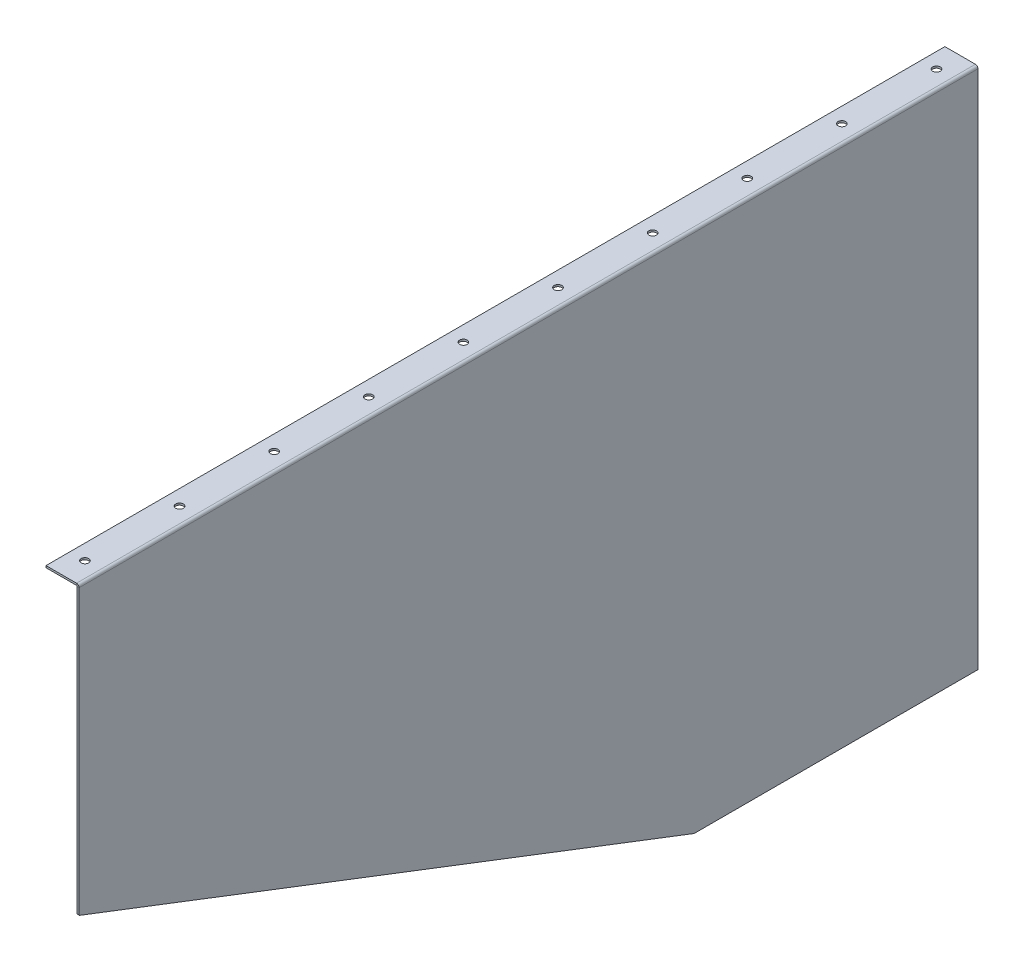
ISO-10303-21;
HEADER;
FILE_DESCRIPTION(('STEP AP214'),'2;1');
FILE_NAME('part.step','',(''),(''),'','','');
FILE_SCHEMA(('AUTOMOTIVE_DESIGN { 1 0 10303 214 1 1 1 1 }'));
ENDSEC;
DATA;
#1=APPLICATION_CONTEXT('core data for automotive mechanical design processes');
#2=APPLICATION_PROTOCOL_DEFINITION('international standard','automotive_design',2000,#1);
#3=PRODUCT_CONTEXT('',#1,'mechanical');
#4=PRODUCT('Part','Part','',(#3));
#5=PRODUCT_RELATED_PRODUCT_CATEGORY('part','',(#4));
#6=PRODUCT_DEFINITION_FORMATION('','',#4);
#7=PRODUCT_DEFINITION_CONTEXT('part definition',#1,'design');
#8=PRODUCT_DEFINITION('design','',#6,#7);
#9=PRODUCT_DEFINITION_SHAPE('','',#8);
#10=(LENGTH_UNIT() NAMED_UNIT(*) SI_UNIT(.MILLI.,.METRE.));
#11=(NAMED_UNIT(*) PLANE_ANGLE_UNIT() SI_UNIT($,.RADIAN.));
#12=(NAMED_UNIT(*) SI_UNIT($,.STERADIAN.) SOLID_ANGLE_UNIT());
#13=UNCERTAINTY_MEASURE_WITH_UNIT(LENGTH_MEASURE(1.E-05),#10,'distance_accuracy_value','');
#14=(GEOMETRIC_REPRESENTATION_CONTEXT(3) GLOBAL_UNCERTAINTY_ASSIGNED_CONTEXT((#13)) GLOBAL_UNIT_ASSIGNED_CONTEXT((#10,
#11,#12)) REPRESENTATION_CONTEXT('',''));
#15=CARTESIAN_POINT('',(0.,0.,0.));
#16=DIRECTION('',(0.,0.,1.));
#17=DIRECTION('',(1.,0.,0.));
#18=AXIS2_PLACEMENT_3D('',#15,#16,#17);
#19=CARTESIAN_POINT('',(-0.00875509888786665,0.736600000000122,0.));
#20=DIRECTION('',(0.,1.,0.));
#21=DIRECTION('',(0.,0.,-1.));
#22=AXIS2_PLACEMENT_3D('',#19,#20,#21);
#23=PLANE('',#22);
#24=CARTESIAN_POINT('',(-18.8726775494439,0.736600000000053,-24.9999999999999));
#25=DIRECTION('',(0.,-1.,0.));
#26=DIRECTION('',(1.,0.,0.));
#27=AXIS2_PLACEMENT_3D('',#24,#25,#26);
#28=CIRCLE('',#27,4.);
#29=CARTESIAN_POINT('',(-14.8726775494439,0.736600000000067,-24.9999999999999));
#30=VERTEX_POINT('',#29);
#31=EDGE_CURVE('E217',#30,#30,#28,.T.);
#32=ORIENTED_EDGE('',*,*,#31,.F.);
#33=EDGE_LOOP('',(#32));
#34=FACE_BOUND('',#33,.T.);
#35=CARTESIAN_POINT('',(-18.8726775494429,0.736600000000041,-125.));
#36=DIRECTION('',(0.,-1.,0.));
#37=DIRECTION('',(1.,0.,0.));
#38=AXIS2_PLACEMENT_3D('',#35,#36,#37);
#39=CIRCLE('',#38,4.00000000000001);
#40=CARTESIAN_POINT('',(-14.8726775494429,0.736600000000055,-125.));
#41=VERTEX_POINT('',#40);
#42=EDGE_CURVE('E728',#41,#41,#39,.T.);
#43=ORIENTED_EDGE('',*,*,#42,.F.);
#44=EDGE_LOOP('',(#43));
#45=FACE_BOUND('',#44,.T.);
#46=CARTESIAN_POINT('',(-18.8726775494419,0.736600000000029,-225.));
#47=DIRECTION('',(0.,-1.,0.));
#48=DIRECTION('',(1.,0.,0.));
#49=AXIS2_PLACEMENT_3D('',#46,#47,#48);
#50=CIRCLE('',#49,4.00000000000001);
#51=CARTESIAN_POINT('',(-14.8726775494419,0.736600000000043,-225.));
#52=VERTEX_POINT('',#51);
#53=EDGE_CURVE('E732',#52,#52,#50,.T.);
#54=ORIENTED_EDGE('',*,*,#53,.F.);
#55=EDGE_LOOP('',(#54));
#56=FACE_BOUND('',#55,.T.);
#57=CARTESIAN_POINT('',(-18.8726775494408,0.736600000000018,-325.));
#58=DIRECTION('',(0.,-1.,0.));
#59=DIRECTION('',(1.,0.,0.));
#60=AXIS2_PLACEMENT_3D('',#57,#58,#59);
#61=CIRCLE('',#60,4.00000000000001);
#62=CARTESIAN_POINT('',(-14.8726775494408,0.736600000000032,-325.));
#63=VERTEX_POINT('',#62);
#64=EDGE_CURVE('E737',#63,#63,#61,.T.);
#65=ORIENTED_EDGE('',*,*,#64,.F.);
#66=EDGE_LOOP('',(#65));
#67=FACE_BOUND('',#66,.T.);
#68=CARTESIAN_POINT('',(-18.8726775494398,0.736600000000006,-425.));
#69=DIRECTION('',(0.,-1.,0.));
#70=DIRECTION('',(1.,0.,0.));
#71=AXIS2_PLACEMENT_3D('',#68,#69,#70);
#72=CIRCLE('',#71,4.);
#73=CARTESIAN_POINT('',(-14.8726775494398,0.73660000000002,-425.));
#74=VERTEX_POINT('',#73);
#75=EDGE_CURVE('E741',#74,#74,#72,.T.);
#76=ORIENTED_EDGE('',*,*,#75,.F.);
#77=EDGE_LOOP('',(#76));
#78=FACE_BOUND('',#77,.T.);
#79=CARTESIAN_POINT('',(-18.8726775494387,0.736599999999994,-525.));
#80=DIRECTION('',(0.,-1.,0.));
#81=DIRECTION('',(1.,0.,0.));
#82=AXIS2_PLACEMENT_3D('',#79,#80,#81);
#83=CIRCLE('',#82,4.);
#84=CARTESIAN_POINT('',(-14.8726775494387,0.736600000000008,-525.));
#85=VERTEX_POINT('',#84);
#86=EDGE_CURVE('E745',#85,#85,#83,.T.);
#87=ORIENTED_EDGE('',*,*,#86,.F.);
#88=EDGE_LOOP('',(#87));
#89=FACE_BOUND('',#88,.T.);
#90=CARTESIAN_POINT('',(-18.8726775494377,0.736599999999982,-625.));
#91=DIRECTION('',(0.,-1.,0.));
#92=DIRECTION('',(1.,0.,0.));
#93=AXIS2_PLACEMENT_3D('',#90,#91,#92);
#94=CIRCLE('',#93,4.00000000000001);
#95=CARTESIAN_POINT('',(-14.8726775494377,0.736599999999996,-625.));
#96=VERTEX_POINT('',#95);
#97=EDGE_CURVE('E749',#96,#96,#94,.T.);
#98=ORIENTED_EDGE('',*,*,#97,.F.);
#99=EDGE_LOOP('',(#98));
#100=FACE_BOUND('',#99,.T.);
#101=CARTESIAN_POINT('',(-18.8726775494366,0.73659999999997,-725.));
#102=DIRECTION('',(0.,-1.,0.));
#103=DIRECTION('',(1.,0.,0.));
#104=AXIS2_PLACEMENT_3D('',#101,#102,#103);
#105=CIRCLE('',#104,4.00000000000001);
#106=CARTESIAN_POINT('',(-14.8726775494366,0.736599999999984,-725.));
#107=VERTEX_POINT('',#106);
#108=EDGE_CURVE('E753',#107,#107,#105,.T.);
#109=ORIENTED_EDGE('',*,*,#108,.F.);
#110=EDGE_LOOP('',(#109));
#111=FACE_BOUND('',#110,.T.);
#112=CARTESIAN_POINT('',(-18.8726775494356,0.736599999999959,-825.));
#113=DIRECTION('',(0.,-1.,0.));
#114=DIRECTION('',(1.,0.,0.));
#115=AXIS2_PLACEMENT_3D('',#112,#113,#114);
#116=CIRCLE('',#115,4.00000000000001);
#117=CARTESIAN_POINT('',(-14.8726775494356,0.736599999999973,-825.));
#118=VERTEX_POINT('',#117);
#119=EDGE_CURVE('E757',#118,#118,#116,.T.);
#120=ORIENTED_EDGE('',*,*,#119,.F.);
#121=EDGE_LOOP('',(#120));
#122=FACE_BOUND('',#121,.T.);
#123=CARTESIAN_POINT('',(-18.8726775494346,0.736599999999947,-925.));
#124=DIRECTION('',(0.,-1.,0.));
#125=DIRECTION('',(1.,0.,0.));
#126=AXIS2_PLACEMENT_3D('',#123,#124,#125);
#127=CIRCLE('',#126,4.00000000000001);
#128=CARTESIAN_POINT('',(-14.8726775494346,0.736599999999961,-925.));
#129=VERTEX_POINT('',#128);
#130=EDGE_CURVE('E761',#129,#129,#127,.T.);
#131=ORIENTED_EDGE('',*,*,#130,.F.);
#132=EDGE_LOOP('',(#131));
#133=FACE_BOUND('',#132,.T.);
#134=DIRECTION('',(-1.,0.,0.));
#135=VECTOR('',#134,1.);
#136=CARTESIAN_POINT('',(-0.00875509888797268,0.73660000000001,-950.));
#137=LINE('',#136,#135);
#138=CARTESIAN_POINT('',(-2.73659999999998,0.7366,-950.));
#139=VERTEX_POINT('',#138);
#140=CARTESIAN_POINT('',(-35.008755098888,0.736599999999887,-950.));
#141=VERTEX_POINT('',#140);
#142=EDGE_CURVE('E145',#139,#141,#137,.T.);
#143=ORIENTED_EDGE('',*,*,#142,.F.);
#144=DIRECTION('',(0.,0.,1.));
#145=VECTOR('',#144,1.);
#146=CARTESIAN_POINT('',(-2.7366,0.736600000000112,0.));
#147=LINE('',#146,#145);
#148=CARTESIAN_POINT('',(-2.7366,0.736600000000112,0.));
#149=VERTEX_POINT('',#148);
#150=EDGE_CURVE('E132',#139,#149,#147,.T.);
#151=ORIENTED_EDGE('',*,*,#150,.T.);
#152=DIRECTION('',(1.,0.,0.));
#153=VECTOR('',#152,1.);
#154=CARTESIAN_POINT('',(-0.00875509888786665,0.736600000000122,0.));
#155=LINE('',#154,#153);
#156=CARTESIAN_POINT('',(-35.0087550988879,0.7366,0.));
#157=VERTEX_POINT('',#156);
#158=EDGE_CURVE('E163',#157,#149,#155,.T.);
#159=ORIENTED_EDGE('',*,*,#158,.F.);
#160=DIRECTION('',(0.,0.,1.));
#161=VECTOR('',#160,1.);
#162=CARTESIAN_POINT('',(-35.0087550988879,0.7366,0.));
#163=LINE('',#162,#161);
#164=EDGE_CURVE('E158',#141,#157,#163,.T.);
#165=ORIENTED_EDGE('',*,*,#164,.F.);
#166=EDGE_LOOP('',(#143,#151,#159,#165));
#167=FACE_BOUND('',#166,.T.);
#168=ADVANCED_FACE('F48',(#34,#45,#56,#67,#78,#89,#100,#111,#122,#133,#167),#23,.F.);
#169=CARTESIAN_POINT('',(-0.00875509888797268,0.73660000000001,-950.));
#170=DIRECTION('',(0.,0.,-1.));
#171=DIRECTION('',(0.,-1.,0.));
#172=AXIS2_PLACEMENT_3D('',#169,#170,#171);
#173=PLANE('',#172);
#174=DIRECTION('',(0.,1.,0.));
#175=VECTOR('',#174,1.);
#176=CARTESIAN_POINT('',(-2.7366,0.7366,-950.));
#177=LINE('',#176,#175);
#178=CARTESIAN_POINT('',(-2.73659999999992,2.7366,-950.));
#179=VERTEX_POINT('',#178);
#180=EDGE_CURVE('E144',#139,#179,#177,.T.);
#181=ORIENTED_EDGE('',*,*,#180,.F.);
#182=ORIENTED_EDGE('',*,*,#142,.T.);
#183=DIRECTION('',(0.,1.,0.));
#184=VECTOR('',#183,1.);
#185=CARTESIAN_POINT('',(-35.008755098888,0.736599999999887,-950.));
#186=LINE('',#185,#184);
#187=CARTESIAN_POINT('',(-35.008755098888,2.73659999999989,-950.));
#188=VERTEX_POINT('',#187);
#189=EDGE_CURVE('E315',#141,#188,#186,.T.);
#190=ORIENTED_EDGE('',*,*,#189,.T.);
#191=DIRECTION('',(-1.,0.,0.));
#192=VECTOR('',#191,1.);
#193=CARTESIAN_POINT('',(-0.00875509888797966,2.73660000000001,-950.));
#194=LINE('',#193,#192);
#195=EDGE_CURVE('E167',#179,#188,#194,.T.);
#196=ORIENTED_EDGE('',*,*,#195,.F.);
#197=EDGE_LOOP('',(#181,#182,#190,#196));
#198=FACE_BOUND('',#197,.T.);
#199=ADVANCED_FACE('F166',(#198),#173,.T.);
#200=CARTESIAN_POINT('',(-0.00875509888786665,0.736600000000122,0.));
#201=DIRECTION('',(0.,0.,1.));
#202=DIRECTION('',(1.,0.,0.));
#203=AXIS2_PLACEMENT_3D('',#200,#201,#202);
#204=PLANE('',#203);
#205=DIRECTION('',(0.,-1.,0.));
#206=VECTOR('',#205,1.);
#207=CARTESIAN_POINT('',(-2.7366,0.736600000000112,0.));
#208=LINE('',#207,#206);
#209=CARTESIAN_POINT('',(-2.73659999999992,2.73660000000011,0.));
#210=VERTEX_POINT('',#209);
#211=EDGE_CURVE('E176',#210,#149,#208,.T.);
#212=ORIENTED_EDGE('',*,*,#211,.F.);
#213=DIRECTION('',(1.,0.,0.));
#214=VECTOR('',#213,1.);
#215=CARTESIAN_POINT('',(-0.00875509888787363,2.73660000000012,0.));
#216=LINE('',#215,#214);
#217=CARTESIAN_POINT('',(-35.0087550988879,2.7366,0.));
#218=VERTEX_POINT('',#217);
#219=EDGE_CURVE('E185',#218,#210,#216,.T.);
#220=ORIENTED_EDGE('',*,*,#219,.F.);
#221=DIRECTION('',(0.,1.,0.));
#222=VECTOR('',#221,1.);
#223=CARTESIAN_POINT('',(-35.0087550988879,0.7366,0.));
#224=LINE('',#223,#222);
#225=EDGE_CURVE('E189',#157,#218,#224,.T.);
#226=ORIENTED_EDGE('',*,*,#225,.F.);
#227=ORIENTED_EDGE('',*,*,#158,.T.);
#228=EDGE_LOOP('',(#212,#220,#226,#227));
#229=FACE_BOUND('',#228,.T.);
#230=ADVANCED_FACE('F374',(#229),#204,.T.);
#231=CARTESIAN_POINT('',(-0.00875509888787363,2.73660000000012,0.));
#232=DIRECTION('',(0.,1.,0.));
#233=DIRECTION('',(0.,0.,-1.));
#234=AXIS2_PLACEMENT_3D('',#231,#232,#233);
#235=PLANE('',#234);
#236=CARTESIAN_POINT('',(-18.8726775494439,2.73660000000005,-24.9999999999999));
#237=DIRECTION('',(0.,1.,0.));
#238=DIRECTION('',(-1.,0.,0.));
#239=AXIS2_PLACEMENT_3D('',#236,#237,#238);
#240=CIRCLE('',#239,4.);
#241=CARTESIAN_POINT('',(-22.8726775494439,2.73660000000004,-24.9999999999999));
#242=VERTEX_POINT('',#241);
#243=EDGE_CURVE('E52',#242,#242,#240,.T.);
#244=ORIENTED_EDGE('',*,*,#243,.F.);
#245=EDGE_LOOP('',(#244));
#246=FACE_BOUND('',#245,.T.);
#247=CARTESIAN_POINT('',(-18.8726775494429,2.73660000000004,-125.));
#248=DIRECTION('',(0.,1.,0.));
#249=DIRECTION('',(-1.,0.,0.));
#250=AXIS2_PLACEMENT_3D('',#247,#248,#249);
#251=CIRCLE('',#250,4.00000000000001);
#252=CARTESIAN_POINT('',(-22.8726775494429,2.73660000000003,-125.));
#253=VERTEX_POINT('',#252);
#254=EDGE_CURVE('E244',#253,#253,#251,.T.);
#255=ORIENTED_EDGE('',*,*,#254,.F.);
#256=EDGE_LOOP('',(#255));
#257=FACE_BOUND('',#256,.T.);
#258=CARTESIAN_POINT('',(-18.8726775494419,2.73660000000003,-225.));
#259=DIRECTION('',(0.,1.,0.));
#260=DIRECTION('',(-1.,0.,0.));
#261=AXIS2_PLACEMENT_3D('',#258,#259,#260);
#262=CIRCLE('',#261,4.00000000000001);
#263=CARTESIAN_POINT('',(-22.8726775494419,2.73660000000002,-225.));
#264=VERTEX_POINT('',#263);
#265=EDGE_CURVE('E241',#264,#264,#262,.T.);
#266=ORIENTED_EDGE('',*,*,#265,.F.);
#267=EDGE_LOOP('',(#266));
#268=FACE_BOUND('',#267,.T.);
#269=CARTESIAN_POINT('',(-18.8726775494408,2.73660000000002,-325.));
#270=DIRECTION('',(0.,1.,0.));
#271=DIRECTION('',(-1.,0.,0.));
#272=AXIS2_PLACEMENT_3D('',#269,#270,#271);
#273=CIRCLE('',#272,4.00000000000001);
#274=CARTESIAN_POINT('',(-22.8726775494408,2.7366,-325.));
#275=VERTEX_POINT('',#274);
#276=EDGE_CURVE('E237',#275,#275,#273,.T.);
#277=ORIENTED_EDGE('',*,*,#276,.F.);
#278=EDGE_LOOP('',(#277));
#279=FACE_BOUND('',#278,.T.);
#280=CARTESIAN_POINT('',(-18.8726775494398,2.73660000000001,-425.));
#281=DIRECTION('',(0.,1.,0.));
#282=DIRECTION('',(-1.,0.,0.));
#283=AXIS2_PLACEMENT_3D('',#280,#281,#282);
#284=CIRCLE('',#283,4.);
#285=CARTESIAN_POINT('',(-22.8726775494398,2.73659999999999,-425.));
#286=VERTEX_POINT('',#285);
#287=EDGE_CURVE('E233',#286,#286,#284,.T.);
#288=ORIENTED_EDGE('',*,*,#287,.F.);
#289=EDGE_LOOP('',(#288));
#290=FACE_BOUND('',#289,.T.);
#291=CARTESIAN_POINT('',(-18.8726775494387,2.73659999999999,-525.));
#292=DIRECTION('',(0.,1.,0.));
#293=DIRECTION('',(-1.,0.,0.));
#294=AXIS2_PLACEMENT_3D('',#291,#292,#293);
#295=CIRCLE('',#294,4.);
#296=CARTESIAN_POINT('',(-22.8726775494387,2.73659999999998,-525.));
#297=VERTEX_POINT('',#296);
#298=EDGE_CURVE('E229',#297,#297,#295,.T.);
#299=ORIENTED_EDGE('',*,*,#298,.F.);
#300=EDGE_LOOP('',(#299));
#301=FACE_BOUND('',#300,.T.);
#302=CARTESIAN_POINT('',(-18.8726775494377,2.73659999999998,-625.));
#303=DIRECTION('',(0.,1.,0.));
#304=DIRECTION('',(-1.,0.,0.));
#305=AXIS2_PLACEMENT_3D('',#302,#303,#304);
#306=CIRCLE('',#305,4.00000000000001);
#307=CARTESIAN_POINT('',(-22.8726775494377,2.73659999999997,-625.));
#308=VERTEX_POINT('',#307);
#309=EDGE_CURVE('E225',#308,#308,#306,.T.);
#310=ORIENTED_EDGE('',*,*,#309,.F.);
#311=EDGE_LOOP('',(#310));
#312=FACE_BOUND('',#311,.T.);
#313=CARTESIAN_POINT('',(-18.8726775494367,2.73659999999997,-725.));
#314=DIRECTION('',(0.,1.,0.));
#315=DIRECTION('',(-1.,0.,0.));
#316=AXIS2_PLACEMENT_3D('',#313,#314,#315);
#317=CIRCLE('',#316,4.00000000000001);
#318=CARTESIAN_POINT('',(-22.8726775494367,2.73659999999996,-725.));
#319=VERTEX_POINT('',#318);
#320=EDGE_CURVE('E221',#319,#319,#317,.T.);
#321=ORIENTED_EDGE('',*,*,#320,.F.);
#322=EDGE_LOOP('',(#321));
#323=FACE_BOUND('',#322,.T.);
#324=CARTESIAN_POINT('',(-18.8726775494356,2.73659999999996,-825.));
#325=DIRECTION('',(0.,1.,0.));
#326=DIRECTION('',(-1.,0.,0.));
#327=AXIS2_PLACEMENT_3D('',#324,#325,#326);
#328=CIRCLE('',#327,4.00000000000001);
#329=CARTESIAN_POINT('',(-22.8726775494356,2.73659999999995,-825.));
#330=VERTEX_POINT('',#329);
#331=EDGE_CURVE('E216',#330,#330,#328,.T.);
#332=ORIENTED_EDGE('',*,*,#331,.F.);
#333=EDGE_LOOP('',(#332));
#334=FACE_BOUND('',#333,.T.);
#335=CARTESIAN_POINT('',(-18.8726775494346,2.73659999999995,-925.));
#336=DIRECTION('',(0.,1.,0.));
#337=DIRECTION('',(-1.,0.,0.));
#338=AXIS2_PLACEMENT_3D('',#335,#336,#337);
#339=CIRCLE('',#338,4.00000000000001);
#340=CARTESIAN_POINT('',(-22.8726775494346,2.73659999999993,-925.));
#341=VERTEX_POINT('',#340);
#342=EDGE_CURVE('E212',#341,#341,#339,.T.);
#343=ORIENTED_EDGE('',*,*,#342,.F.);
#344=EDGE_LOOP('',(#343));
#345=FACE_BOUND('',#344,.T.);
#346=DIRECTION('',(0.,0.,1.));
#347=VECTOR('',#346,1.);
#348=CARTESIAN_POINT('',(-2.73660000000001,2.73660000000011,0.));
#349=LINE('',#348,#347);
#350=EDGE_CURVE('E170',#179,#210,#349,.T.);
#351=ORIENTED_EDGE('',*,*,#350,.F.);
#352=ORIENTED_EDGE('',*,*,#195,.T.);
#353=DIRECTION('',(0.,0.,1.));
#354=VECTOR('',#353,1.);
#355=CARTESIAN_POINT('',(-35.0087550988879,2.7366,0.));
#356=LINE('',#355,#354);
#357=EDGE_CURVE('E271',#188,#218,#356,.T.);
#358=ORIENTED_EDGE('',*,*,#357,.T.);
#359=ORIENTED_EDGE('',*,*,#219,.T.);
#360=EDGE_LOOP('',(#351,#352,#358,#359));
#361=FACE_BOUND('',#360,.T.);
#362=ADVANCED_FACE('F328',(#246,#257,#268,#279,#290,#301,#312,#323,#334,#345,#361),#235,.T.);
#363=CARTESIAN_POINT('',(-35.0087550988879,0.7366,0.));
#364=DIRECTION('',(-1.,0.,0.));
#365=DIRECTION('',(0.,0.,1.));
#366=AXIS2_PLACEMENT_3D('',#363,#364,#365);
#367=PLANE('',#366);
#368=ORIENTED_EDGE('',*,*,#357,.F.);
#369=ORIENTED_EDGE('',*,*,#189,.F.);
#370=ORIENTED_EDGE('',*,*,#164,.T.);
#371=ORIENTED_EDGE('',*,*,#225,.T.);
#372=EDGE_LOOP('',(#368,#369,#370,#371));
#373=FACE_BOUND('',#372,.T.);
#374=ADVANCED_FACE('F325',(#373),#367,.T.);
#375=CARTESIAN_POINT('',(-2.,-300.,0.));
#376=DIRECTION('',(0.,-0.93334560620306,0.358979079308869));
#377=DIRECTION('',(0.,-0.358979079308869,-0.93334560620306));
#378=AXIS2_PLACEMENT_3D('',#375,#376,#377);
#379=PLANE('',#378);
#380=DIRECTION('',(0.,-0.358979079308869,-0.93334560620306));
#381=VECTOR('',#380,1.);
#382=CARTESIAN_POINT('',(-2.,-300.,0.));
#383=LINE('',#382,#381);
#384=CARTESIAN_POINT('',(-2.,-300.192306276207,-0.499996318139134));
#385=VERTEX_POINT('',#384);
#386=CARTESIAN_POINT('',(-2.,-549.950675748591,-649.871756946335));
#387=VERTEX_POINT('',#386);
#388=EDGE_CURVE('E306',#385,#387,#383,.T.);
#389=ORIENTED_EDGE('',*,*,#388,.T.);
#390=DIRECTION('',(1.,0.,0.));
#391=VECTOR('',#390,1.);
#392=CARTESIAN_POINT('',(-2.,-549.950675748591,-649.871756946335));
#393=LINE('',#392,#391);
#394=CARTESIAN_POINT('',(0.,-549.950675748591,-649.871756946335));
#395=VERTEX_POINT('',#394);
#396=EDGE_CURVE('E204',#387,#395,#393,.T.);
#397=ORIENTED_EDGE('',*,*,#396,.T.);
#398=DIRECTION('',(0.,-0.358979079308869,-0.93334560620306));
#399=VECTOR('',#398,1.);
#400=CARTESIAN_POINT('',(0.,-300.,0.));
#401=LINE('',#400,#399);
#402=CARTESIAN_POINT('',(0.,-300.192306276207,-0.499996318139134));
#403=VERTEX_POINT('',#402);
#404=EDGE_CURVE('E279',#403,#395,#401,.T.);
#405=ORIENTED_EDGE('',*,*,#404,.F.);
#406=DIRECTION('',(1.,0.,0.));
#407=VECTOR('',#406,1.);
#408=CARTESIAN_POINT('',(-2.,-300.192306276207,-0.499996318139126));
#409=LINE('',#408,#407);
#410=EDGE_CURVE('E198',#403,#385,#409,.F.);
#411=ORIENTED_EDGE('',*,*,#410,.T.);
#412=EDGE_LOOP('',(#389,#397,#405,#411));
#413=FACE_BOUND('',#412,.T.);
#414=ADVANCED_FACE('F356',(#413),#379,.T.);
#415=CARTESIAN_POINT('',(-2.,-550.,-950.));
#416=DIRECTION('',(0.,-1.,0.));
#417=DIRECTION('',(0.,0.,-1.));
#418=AXIS2_PLACEMENT_3D('',#415,#416,#417);
#419=PLANE('',#418);
#420=DIRECTION('',(0.,0.,-1.));
#421=VECTOR('',#420,1.);
#422=CARTESIAN_POINT('',(0.,-550.,-950.));
#423=LINE('',#422,#421);
#424=CARTESIAN_POINT('',(0.,-550.,-650.137401465024));
#425=VERTEX_POINT('',#424);
#426=CARTESIAN_POINT('',(0.,-550.,-950.));
#427=VERTEX_POINT('',#426);
#428=EDGE_CURVE('E276',#425,#427,#423,.T.);
#429=ORIENTED_EDGE('',*,*,#428,.F.);
#430=DIRECTION('',(1.,0.,0.));
#431=VECTOR('',#430,1.);
#432=CARTESIAN_POINT('',(-2.,-550.,-650.137401465024));
#433=LINE('',#432,#431);
#434=CARTESIAN_POINT('',(-2.,-550.,-650.137401465024));
#435=VERTEX_POINT('',#434);
#436=EDGE_CURVE('E58',#425,#435,#433,.F.);
#437=ORIENTED_EDGE('',*,*,#436,.T.);
#438=DIRECTION('',(0.,0.,-1.));
#439=VECTOR('',#438,1.);
#440=CARTESIAN_POINT('',(-2.,-550.,-950.));
#441=LINE('',#440,#439);
#442=CARTESIAN_POINT('',(-2.,-550.,-950.));
#443=VERTEX_POINT('',#442);
#444=EDGE_CURVE('E303',#435,#443,#441,.T.);
#445=ORIENTED_EDGE('',*,*,#444,.T.);
#446=DIRECTION('',(1.,0.,0.));
#447=VECTOR('',#446,1.);
#448=CARTESIAN_POINT('',(-2.,-550.,-950.));
#449=LINE('',#448,#447);
#450=EDGE_CURVE('E299',#443,#427,#449,.T.);
#451=ORIENTED_EDGE('',*,*,#450,.T.);
#452=EDGE_LOOP('',(#429,#437,#445,#451));
#453=FACE_BOUND('',#452,.T.);
#454=ADVANCED_FACE('F407',(#453),#419,.T.);
#455=CARTESIAN_POINT('',(-2.,0.,0.));
#456=DIRECTION('',(1.,0.,0.));
#457=DIRECTION('',(0.,0.,-1.));
#458=AXIS2_PLACEMENT_3D('',#455,#456,#457);
#459=PLANE('',#458);
#460=ORIENTED_EDGE('',*,*,#444,.F.);
#461=CARTESIAN_POINT('',(-2.,-549.26,-650.137401465024));
#462=DIRECTION('',(1.,0.,0.));
#463=DIRECTION('',(0.,0.,-1.));
#464=AXIS2_PLACEMENT_3D('',#461,#462,#463);
#465=CIRCLE('',#464,0.74);
#466=EDGE_CURVE('E12',#435,#387,#465,.F.);
#467=ORIENTED_EDGE('',*,*,#466,.T.);
#468=ORIENTED_EDGE('',*,*,#388,.F.);
#469=CARTESIAN_POINT('',(-2.,-299.464296703369,-0.780000000000037));
#470=DIRECTION('',(1.,0.,0.));
#471=DIRECTION('',(0.,0.,-1.));
#472=AXIS2_PLACEMENT_3D('',#469,#470,#471);
#473=CIRCLE('',#472,0.78);
#474=CARTESIAN_POINT('',(-2.,-299.464296703369,0.));
#475=VERTEX_POINT('',#474);
#476=EDGE_CURVE('E201',#385,#475,#473,.F.);
#477=ORIENTED_EDGE('',*,*,#476,.T.);
#478=DIRECTION('',(0.,-1.,0.));
#479=VECTOR('',#478,1.);
#480=CARTESIAN_POINT('',(-2.,0.,0.));
#481=LINE('',#480,#479);
#482=CARTESIAN_POINT('',(-2.,1.20663055799989E-13,0.));
#483=VERTEX_POINT('',#482);
#484=EDGE_CURVE('E268',#483,#475,#481,.T.);
#485=ORIENTED_EDGE('',*,*,#484,.F.);
#486=DIRECTION('',(0.,0.,1.));
#487=VECTOR('',#486,1.);
#488=CARTESIAN_POINT('',(-2.,1.12157288819922E-13,0.));
#489=LINE('',#488,#487);
#490=CARTESIAN_POINT('',(-2.,0.,-950.));
#491=VERTEX_POINT('',#490);
#492=EDGE_CURVE('E310',#491,#483,#489,.T.);
#493=ORIENTED_EDGE('',*,*,#492,.F.);
#494=DIRECTION('',(0.,1.,0.));
#495=VECTOR('',#494,1.);
#496=CARTESIAN_POINT('',(-2.,0.,-950.));
#497=LINE('',#496,#495);
#498=EDGE_CURVE('E295',#443,#491,#497,.T.);
#499=ORIENTED_EDGE('',*,*,#498,.F.);
#500=EDGE_LOOP('',(#460,#467,#468,#477,#485,#493,#499));
#501=FACE_BOUND('',#500,.T.);
#502=ADVANCED_FACE('F347',(#501),#459,.F.);
#503=CARTESIAN_POINT('',(-2.,0.,-950.));
#504=DIRECTION('',(0.,0.,-1.));
#505=DIRECTION('',(-1.,0.,0.));
#506=AXIS2_PLACEMENT_3D('',#503,#504,#505);
#507=PLANE('',#506);
#508=ORIENTED_EDGE('',*,*,#498,.T.);
#509=DIRECTION('',(1.,0.,0.));
#510=VECTOR('',#509,1.);
#511=CARTESIAN_POINT('',(-2.,0.,-950.));
#512=LINE('',#511,#510);
#513=CARTESIAN_POINT('',(0.,0.,-950.));
#514=VERTEX_POINT('',#513);
#515=EDGE_CURVE('E152',#491,#514,#512,.T.);
#516=ORIENTED_EDGE('',*,*,#515,.T.);
#517=DIRECTION('',(0.,1.,0.));
#518=VECTOR('',#517,1.);
#519=CARTESIAN_POINT('',(0.,0.,-950.));
#520=LINE('',#519,#518);
#521=EDGE_CURVE('E290',#427,#514,#520,.T.);
#522=ORIENTED_EDGE('',*,*,#521,.F.);
#523=ORIENTED_EDGE('',*,*,#450,.F.);
#524=EDGE_LOOP('',(#508,#516,#522,#523));
#525=FACE_BOUND('',#524,.T.);
#526=ADVANCED_FACE('F344',(#525),#507,.T.);
#527=CARTESIAN_POINT('',(0.,0.,0.));
#528=DIRECTION('',(1.,0.,0.));
#529=DIRECTION('',(0.,0.,-1.));
#530=AXIS2_PLACEMENT_3D('',#527,#528,#529);
#531=PLANE('',#530);
#532=ORIENTED_EDGE('',*,*,#404,.T.);
#533=CARTESIAN_POINT('',(0.,-549.26,-650.137401465024));
#534=DIRECTION('',(1.,0.,0.));
#535=DIRECTION('',(0.,0.,-1.));
#536=AXIS2_PLACEMENT_3D('',#533,#534,#535);
#537=CIRCLE('',#536,0.74);
#538=EDGE_CURVE('E73',#395,#425,#537,.T.);
#539=ORIENTED_EDGE('',*,*,#538,.T.);
#540=ORIENTED_EDGE('',*,*,#428,.T.);
#541=ORIENTED_EDGE('',*,*,#521,.T.);
#542=DIRECTION('',(0.,0.,1.));
#543=VECTOR('',#542,1.);
#544=CARTESIAN_POINT('',(0.,1.12157288819922E-13,0.));
#545=LINE('',#544,#543);
#546=CARTESIAN_POINT('',(0.,2.32031368611504E-13,0.));
#547=VERTEX_POINT('',#546);
#548=EDGE_CURVE('E286',#514,#547,#545,.T.);
#549=ORIENTED_EDGE('',*,*,#548,.T.);
#550=DIRECTION('',(0.,-1.,0.));
#551=VECTOR('',#550,1.);
#552=CARTESIAN_POINT('',(0.,0.,0.));
#553=LINE('',#552,#551);
#554=CARTESIAN_POINT('',(0.,-299.464296703369,0.));
#555=VERTEX_POINT('',#554);
#556=EDGE_CURVE('E282',#547,#555,#553,.T.);
#557=ORIENTED_EDGE('',*,*,#556,.T.);
#558=CARTESIAN_POINT('',(0.,-299.464296703369,-0.780000000000037));
#559=DIRECTION('',(1.,0.,0.));
#560=DIRECTION('',(0.,0.,-1.));
#561=AXIS2_PLACEMENT_3D('',#558,#559,#560);
#562=CIRCLE('',#561,0.78);
#563=EDGE_CURVE('E195',#555,#403,#562,.T.);
#564=ORIENTED_EDGE('',*,*,#563,.T.);
#565=EDGE_LOOP('',(#532,#539,#540,#541,#549,#557,#564));
#566=FACE_BOUND('',#565,.T.);
#567=ADVANCED_FACE('F340',(#566),#531,.T.);
#568=CARTESIAN_POINT('',(-2.,0.,0.));
#569=DIRECTION('',(0.,0.,1.));
#570=DIRECTION('',(0.,-1.,0.));
#571=AXIS2_PLACEMENT_3D('',#568,#569,#570);
#572=PLANE('',#571);
#573=ORIENTED_EDGE('',*,*,#484,.T.);
#574=DIRECTION('',(1.,0.,0.));
#575=VECTOR('',#574,1.);
#576=CARTESIAN_POINT('',(-2.,-299.464296703369,0.));
#577=LINE('',#576,#575);
#578=EDGE_CURVE('E182',#475,#555,#577,.T.);
#579=ORIENTED_EDGE('',*,*,#578,.T.);
#580=ORIENTED_EDGE('',*,*,#556,.F.);
#581=DIRECTION('',(-1.,0.,0.));
#582=VECTOR('',#581,1.);
#583=CARTESIAN_POINT('',(-2.,1.12157288819922E-13,0.));
#584=LINE('',#583,#582);
#585=EDGE_CURVE('E272',#547,#483,#584,.T.);
#586=ORIENTED_EDGE('',*,*,#585,.T.);
#587=EDGE_LOOP('',(#573,#579,#580,#586));
#588=FACE_BOUND('',#587,.T.);
#589=ADVANCED_FACE('F338',(#588),#572,.T.);
#590=CARTESIAN_POINT('',(-2.7366,0.,-950.));
#591=DIRECTION('',(0.,0.,1.));
#592=DIRECTION('',(1.,0.,0.));
#593=AXIS2_PLACEMENT_3D('',#590,#591,#592);
#594=PLANE('',#593);
#595=ORIENTED_EDGE('',*,*,#180,.T.);
#596=CARTESIAN_POINT('',(-2.7366,0.,-950.));
#597=DIRECTION('',(0.,0.,-1.));
#598=DIRECTION('',(0.,1.,0.));
#599=AXIS2_PLACEMENT_3D('',#596,#597,#598);
#600=CIRCLE('',#599,2.7366);
#601=EDGE_CURVE('E254',#179,#514,#600,.T.);
#602=ORIENTED_EDGE('',*,*,#601,.T.);
#603=ORIENTED_EDGE('',*,*,#515,.F.);
#604=CARTESIAN_POINT('',(-2.7366,0.,-950.));
#605=DIRECTION('',(0.,0.,-1.));
#606=DIRECTION('',(1.,0.,0.));
#607=AXIS2_PLACEMENT_3D('',#604,#605,#606);
#608=CIRCLE('',#607,0.7366);
#609=EDGE_CURVE('E135',#139,#491,#608,.T.);
#610=ORIENTED_EDGE('',*,*,#609,.F.);
#611=EDGE_LOOP('',(#595,#602,#603,#610));
#612=FACE_BOUND('',#611,.T.);
#613=ADVANCED_FACE('F148',(#612),#594,.F.);
#614=CARTESIAN_POINT('',(-2.7366,1.12157288819922E-13,0.));
#615=DIRECTION('',(0.,0.,-1.));
#616=DIRECTION('',(0.,1.,0.));
#617=AXIS2_PLACEMENT_3D('',#614,#615,#616);
#618=PLANE('',#617);
#619=CARTESIAN_POINT('',(-2.7366,1.12157288819922E-13,0.));
#620=DIRECTION('',(0.,0.,-1.));
#621=DIRECTION('',(0.,1.,0.));
#622=AXIS2_PLACEMENT_3D('',#619,#620,#621);
#623=CIRCLE('',#622,2.7366);
#624=EDGE_CURVE('E154',#547,#210,#623,.F.);
#625=ORIENTED_EDGE('',*,*,#624,.T.);
#626=ORIENTED_EDGE('',*,*,#211,.T.);
#627=CARTESIAN_POINT('',(-2.7366,1.12157288819922E-13,0.));
#628=DIRECTION('',(0.,0.,1.));
#629=DIRECTION('',(0.,1.,0.));
#630=AXIS2_PLACEMENT_3D('',#627,#628,#629);
#631=CIRCLE('',#630,0.7366);
#632=EDGE_CURVE('E138',#483,#149,#631,.T.);
#633=ORIENTED_EDGE('',*,*,#632,.F.);
#634=ORIENTED_EDGE('',*,*,#585,.F.);
#635=EDGE_LOOP('',(#625,#626,#633,#634));
#636=FACE_BOUND('',#635,.T.);
#637=ADVANCED_FACE('F335',(#636),#618,.F.);
#638=CARTESIAN_POINT('',(-2.7366,1.68236644145634E-13,475.006021632392));
#639=DIRECTION('',(0.,0.,-1.));
#640=DIRECTION('',(0.,1.,0.));
#641=AXIS2_PLACEMENT_3D('',#638,#639,#640);
#642=CYLINDRICAL_SURFACE('',#641,0.7366);
#643=ORIENTED_EDGE('',*,*,#492,.T.);
#644=ORIENTED_EDGE('',*,*,#632,.T.);
#645=ORIENTED_EDGE('',*,*,#150,.F.);
#646=ORIENTED_EDGE('',*,*,#609,.T.);
#647=EDGE_LOOP('',(#643,#644,#645,#646));
#648=FACE_BOUND('',#647,.T.);
#649=ADVANCED_FACE('F134',(#648),#642,.F.);
#650=CARTESIAN_POINT('',(-2.7366,1.68236644145634E-13,475.006021632392));
#651=DIRECTION('',(0.,0.,-1.));
#652=DIRECTION('',(0.,1.,0.));
#653=AXIS2_PLACEMENT_3D('',#650,#651,#652);
#654=CYLINDRICAL_SURFACE('',#653,2.7366);
#655=ORIENTED_EDGE('',*,*,#548,.F.);
#656=ORIENTED_EDGE('',*,*,#601,.F.);
#657=ORIENTED_EDGE('',*,*,#350,.T.);
#658=ORIENTED_EDGE('',*,*,#624,.F.);
#659=EDGE_LOOP('',(#655,#656,#657,#658));
#660=FACE_BOUND('',#659,.T.);
#661=ADVANCED_FACE('F332',(#660),#654,.T.);
#662=CARTESIAN_POINT('',(-2.,-299.464296703369,-0.780000000000037));
#663=DIRECTION('',(1.,0.,0.));
#664=DIRECTION('',(0.,0.,-1.));
#665=AXIS2_PLACEMENT_3D('',#662,#663,#664);
#666=CYLINDRICAL_SURFACE('',#665,0.78);
#667=ORIENTED_EDGE('',*,*,#476,.F.);
#668=ORIENTED_EDGE('',*,*,#410,.F.);
#669=ORIENTED_EDGE('',*,*,#563,.F.);
#670=ORIENTED_EDGE('',*,*,#578,.F.);
#671=EDGE_LOOP('',(#667,#668,#669,#670));
#672=FACE_BOUND('',#671,.T.);
#673=ADVANCED_FACE('F353',(#672),#666,.T.);
#674=CARTESIAN_POINT('',(-2.,-549.26,-650.137401465024));
#675=DIRECTION('',(1.,0.,0.));
#676=DIRECTION('',(0.,0.,-1.));
#677=AXIS2_PLACEMENT_3D('',#674,#675,#676);
#678=CYLINDRICAL_SURFACE('',#677,0.74);
#679=ORIENTED_EDGE('',*,*,#466,.F.);
#680=ORIENTED_EDGE('',*,*,#436,.F.);
#681=ORIENTED_EDGE('',*,*,#538,.F.);
#682=ORIENTED_EDGE('',*,*,#396,.F.);
#683=EDGE_LOOP('',(#679,#680,#681,#682));
#684=FACE_BOUND('',#683,.T.);
#685=ADVANCED_FACE('F50',(#684),#678,.T.);
#686=CARTESIAN_POINT('',(-18.8726775494346,3.73659999999995,-925.));
#687=DIRECTION('',(0.,-1.,0.));
#688=DIRECTION('',(1.,0.,0.));
#689=AXIS2_PLACEMENT_3D('',#686,#687,#688);
#690=CYLINDRICAL_SURFACE('',#689,4.00000000000001);
#691=ORIENTED_EDGE('',*,*,#342,.T.);
#692=EDGE_LOOP('',(#691));
#693=FACE_BOUND('',#692,.T.);
#694=ORIENTED_EDGE('',*,*,#130,.T.);
#695=EDGE_LOOP('',(#694));
#696=FACE_BOUND('',#695,.T.);
#697=ADVANCED_FACE('F360',(#693,#696),#690,.F.);
#698=CARTESIAN_POINT('',(-18.8726775494356,3.73659999999996,-825.));
#699=DIRECTION('',(0.,-1.,0.));
#700=DIRECTION('',(1.,0.,0.));
#701=AXIS2_PLACEMENT_3D('',#698,#699,#700);
#702=CYLINDRICAL_SURFACE('',#701,4.00000000000001);
#703=ORIENTED_EDGE('',*,*,#331,.T.);
#704=EDGE_LOOP('',(#703));
#705=FACE_BOUND('',#704,.T.);
#706=ORIENTED_EDGE('',*,*,#119,.T.);
#707=EDGE_LOOP('',(#706));
#708=FACE_BOUND('',#707,.T.);
#709=ADVANCED_FACE('F365',(#705,#708),#702,.F.);
#710=CARTESIAN_POINT('',(-18.8726775494367,3.73659999999997,-725.));
#711=DIRECTION('',(0.,-1.,0.));
#712=DIRECTION('',(1.,0.,0.));
#713=AXIS2_PLACEMENT_3D('',#710,#711,#712);
#714=CYLINDRICAL_SURFACE('',#713,4.00000000000001);
#715=ORIENTED_EDGE('',*,*,#320,.T.);
#716=EDGE_LOOP('',(#715));
#717=FACE_BOUND('',#716,.T.);
#718=ORIENTED_EDGE('',*,*,#108,.T.);
#719=EDGE_LOOP('',(#718));
#720=FACE_BOUND('',#719,.T.);
#721=ADVANCED_FACE('F493',(#717,#720),#714,.F.);
#722=CARTESIAN_POINT('',(-18.8726775494377,3.73659999999998,-625.));
#723=DIRECTION('',(0.,-1.,0.));
#724=DIRECTION('',(1.,0.,0.));
#725=AXIS2_PLACEMENT_3D('',#722,#723,#724);
#726=CYLINDRICAL_SURFACE('',#725,4.00000000000001);
#727=ORIENTED_EDGE('',*,*,#309,.T.);
#728=EDGE_LOOP('',(#727));
#729=FACE_BOUND('',#728,.T.);
#730=ORIENTED_EDGE('',*,*,#97,.T.);
#731=EDGE_LOOP('',(#730));
#732=FACE_BOUND('',#731,.T.);
#733=ADVANCED_FACE('F505',(#729,#732),#726,.F.);
#734=CARTESIAN_POINT('',(-18.8726775494387,3.73659999999999,-525.));
#735=DIRECTION('',(0.,-1.,0.));
#736=DIRECTION('',(1.,0.,0.));
#737=AXIS2_PLACEMENT_3D('',#734,#735,#736);
#738=CYLINDRICAL_SURFACE('',#737,4.);
#739=ORIENTED_EDGE('',*,*,#298,.T.);
#740=EDGE_LOOP('',(#739));
#741=FACE_BOUND('',#740,.T.);
#742=ORIENTED_EDGE('',*,*,#86,.T.);
#743=EDGE_LOOP('',(#742));
#744=FACE_BOUND('',#743,.T.);
#745=ADVANCED_FACE('F517',(#741,#744),#738,.F.);
#746=CARTESIAN_POINT('',(-18.8726775494398,3.73660000000001,-425.));
#747=DIRECTION('',(0.,-1.,0.));
#748=DIRECTION('',(1.,0.,0.));
#749=AXIS2_PLACEMENT_3D('',#746,#747,#748);
#750=CYLINDRICAL_SURFACE('',#749,4.);
#751=ORIENTED_EDGE('',*,*,#287,.T.);
#752=EDGE_LOOP('',(#751));
#753=FACE_BOUND('',#752,.T.);
#754=ORIENTED_EDGE('',*,*,#75,.T.);
#755=EDGE_LOOP('',(#754));
#756=FACE_BOUND('',#755,.T.);
#757=ADVANCED_FACE('F529',(#753,#756),#750,.F.);
#758=CARTESIAN_POINT('',(-18.8726775494408,3.73660000000002,-325.));
#759=DIRECTION('',(0.,-1.,0.));
#760=DIRECTION('',(1.,0.,0.));
#761=AXIS2_PLACEMENT_3D('',#758,#759,#760);
#762=CYLINDRICAL_SURFACE('',#761,4.00000000000001);
#763=ORIENTED_EDGE('',*,*,#276,.T.);
#764=EDGE_LOOP('',(#763));
#765=FACE_BOUND('',#764,.T.);
#766=ORIENTED_EDGE('',*,*,#64,.T.);
#767=EDGE_LOOP('',(#766));
#768=FACE_BOUND('',#767,.T.);
#769=ADVANCED_FACE('F541',(#765,#768),#762,.F.);
#770=CARTESIAN_POINT('',(-18.8726775494419,3.73660000000003,-225.));
#771=DIRECTION('',(0.,-1.,0.));
#772=DIRECTION('',(1.,0.,0.));
#773=AXIS2_PLACEMENT_3D('',#770,#771,#772);
#774=CYLINDRICAL_SURFACE('',#773,4.00000000000001);
#775=ORIENTED_EDGE('',*,*,#265,.T.);
#776=EDGE_LOOP('',(#775));
#777=FACE_BOUND('',#776,.T.);
#778=ORIENTED_EDGE('',*,*,#53,.T.);
#779=EDGE_LOOP('',(#778));
#780=FACE_BOUND('',#779,.T.);
#781=ADVANCED_FACE('F553',(#777,#780),#774,.F.);
#782=CARTESIAN_POINT('',(-18.8726775494429,3.73660000000004,-125.));
#783=DIRECTION('',(0.,-1.,0.));
#784=DIRECTION('',(1.,0.,0.));
#785=AXIS2_PLACEMENT_3D('',#782,#783,#784);
#786=CYLINDRICAL_SURFACE('',#785,4.00000000000001);
#787=ORIENTED_EDGE('',*,*,#254,.T.);
#788=EDGE_LOOP('',(#787));
#789=FACE_BOUND('',#788,.T.);
#790=ORIENTED_EDGE('',*,*,#42,.T.);
#791=EDGE_LOOP('',(#790));
#792=FACE_BOUND('',#791,.T.);
#793=ADVANCED_FACE('F565',(#789,#792),#786,.F.);
#794=CARTESIAN_POINT('',(-18.8726775494439,3.73660000000005,-24.9999999999999));
#795=DIRECTION('',(0.,-1.,0.));
#796=DIRECTION('',(1.,0.,0.));
#797=AXIS2_PLACEMENT_3D('',#794,#795,#796);
#798=CYLINDRICAL_SURFACE('',#797,4.);
#799=ORIENTED_EDGE('',*,*,#243,.T.);
#800=EDGE_LOOP('',(#799));
#801=FACE_BOUND('',#800,.T.);
#802=ORIENTED_EDGE('',*,*,#31,.T.);
#803=EDGE_LOOP('',(#802));
#804=FACE_BOUND('',#803,.T.);
#805=ADVANCED_FACE('F577',(#801,#804),#798,.F.);
#806=CLOSED_SHELL('',(#168,#199,#230,#362,#374,#414,#454,#502,#526,#567,#589,#613,#637,#649,
#661,#673,#685,#697,#709,#721,#733,#745,#757,#769,#781,#793,#805));
#807=MANIFOLD_SOLID_BREP('B2',#806);
#808=ADVANCED_BREP_SHAPE_REPRESENTATION('',(#18,#807),#14);
#809=SHAPE_DEFINITION_REPRESENTATION(#9,#808);
ENDSEC;
END-ISO-10303-21;
